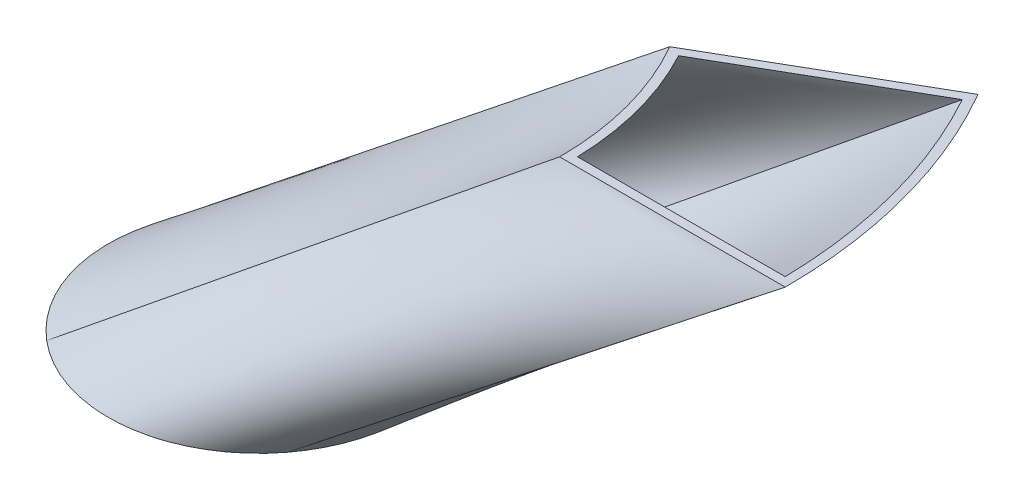
ISO-10303-21;
HEADER;
FILE_DESCRIPTION(('STEP AP214'),'2;1');
FILE_NAME('part.step','',(''),(''),'','','');
FILE_SCHEMA(('AUTOMOTIVE_DESIGN { 1 0 10303 214 1 1 1 1 }'));
ENDSEC;
DATA;
#1=APPLICATION_CONTEXT('core data for automotive mechanical design processes');
#2=APPLICATION_PROTOCOL_DEFINITION('international standard','automotive_design',2000,#1);
#3=PRODUCT_CONTEXT('',#1,'mechanical');
#4=PRODUCT('Part','Part','',(#3));
#5=PRODUCT_RELATED_PRODUCT_CATEGORY('part','',(#4));
#6=PRODUCT_DEFINITION_FORMATION('','',#4);
#7=PRODUCT_DEFINITION_CONTEXT('part definition',#1,'design');
#8=PRODUCT_DEFINITION('design','',#6,#7);
#9=PRODUCT_DEFINITION_SHAPE('','',#8);
#10=(LENGTH_UNIT() NAMED_UNIT(*) SI_UNIT(.MILLI.,.METRE.));
#11=(NAMED_UNIT(*) PLANE_ANGLE_UNIT() SI_UNIT($,.RADIAN.));
#12=(NAMED_UNIT(*) SI_UNIT($,.STERADIAN.) SOLID_ANGLE_UNIT());
#13=UNCERTAINTY_MEASURE_WITH_UNIT(LENGTH_MEASURE(1.E-05),#10,'distance_accuracy_value','');
#14=(GEOMETRIC_REPRESENTATION_CONTEXT(3) GLOBAL_UNCERTAINTY_ASSIGNED_CONTEXT((#13)) GLOBAL_UNIT_ASSIGNED_CONTEXT((#10,
#11,#12)) REPRESENTATION_CONTEXT('',''));
#15=CARTESIAN_POINT('',(0.,0.,0.));
#16=DIRECTION('',(0.,0.,1.));
#17=DIRECTION('',(1.,0.,0.));
#18=AXIS2_PLACEMENT_3D('',#15,#16,#17);
#19=CARTESIAN_POINT('',(-9.47385091124638E-13,-100.,0.));
#20=DIRECTION('',(0.,-1.,0.));
#21=DIRECTION('',(1.,0.,0.));
#22=AXIS2_PLACEMENT_3D('',#19,#20,#21);
#23=PLANE('',#22);
#24=CARTESIAN_POINT('',(-9.47385091124638E-13,-100.,0.));
#25=DIRECTION('',(0.,-1.,0.));
#26=DIRECTION('',(1.,0.,0.));
#27=AXIS2_PLACEMENT_3D('',#24,#25,#26);
#28=CIRCLE('',#27,47.);
#29=CARTESIAN_POINT('',(-44.2521494595978,-99.9999999999997,-15.8350013642407));
#30=VERTEX_POINT('',#29);
#31=CARTESIAN_POINT('',(18.164088977322,-100.,-43.3481934066911));
#32=VERTEX_POINT('',#31);
#33=EDGE_CURVE('E74',#30,#32,#28,.T.);
#34=ORIENTED_EDGE('',*,*,#33,.F.);
#35=CARTESIAN_POINT('',(-9.47385091124638E-13,-100.,0.));
#36=DIRECTION('',(0.,-1.,0.));
#37=DIRECTION('',(1.,0.,0.));
#38=AXIS2_PLACEMENT_3D('',#35,#36,#37);
#39=CIRCLE('',#38,47.);
#40=CARTESIAN_POINT('',(-30.4059849219572,-99.9999999999998,35.8395881801922));
#41=VERTEX_POINT('',#40);
#42=EDGE_CURVE('E143',#41,#30,#39,.T.);
#43=ORIENTED_EDGE('',*,*,#42,.F.);
#44=CARTESIAN_POINT('',(-9.47385091124638E-13,-100.,0.));
#45=DIRECTION('',(0.,-1.,0.));
#46=DIRECTION('',(1.,0.,0.));
#47=AXIS2_PLACEMENT_3D('',#44,#45,#46);
#48=CIRCLE('',#47,47.);
#49=CARTESIAN_POINT('',(37.4046591943072,-100.,28.4585922096941));
#50=VERTEX_POINT('',#49);
#51=EDGE_CURVE('E243',#50,#41,#48,.T.);
#52=ORIENTED_EDGE('',*,*,#51,.F.);
#53=CARTESIAN_POINT('',(-9.47385091124638E-13,-100.,0.));
#54=DIRECTION('',(0.,-1.,0.));
#55=DIRECTION('',(1.,0.,0.));
#56=AXIS2_PLACEMENT_3D('',#53,#54,#55);
#57=CIRCLE('',#56,47.);
#58=EDGE_CURVE('E262',#32,#50,#57,.T.);
#59=ORIENTED_EDGE('',*,*,#58,.F.);
#60=EDGE_LOOP('',(#34,#43,#52,#59));
#61=FACE_BOUND('',#60,.T.);
#62=CARTESIAN_POINT('',(-9.47385091124638E-13,-100.,0.));
#63=DIRECTION('',(0.,-1.,0.));
#64=DIRECTION('',(1.,0.,0.));
#65=AXIS2_PLACEMENT_3D('',#62,#63,#64);
#66=CIRCLE('',#65,50.);
#67=CARTESIAN_POINT('',(39.7921906322417,-100.,30.2750980954192));
#68=VERTEX_POINT('',#67);
#69=CARTESIAN_POINT('',(-32.3467924701671,-99.9999999999998,38.1272214682895));
#70=VERTEX_POINT('',#69);
#71=EDGE_CURVE('E12',#68,#70,#66,.T.);
#72=ORIENTED_EDGE('',*,*,#71,.T.);
#73=CARTESIAN_POINT('',(-47.0767547442529,-99.9999999999997,-16.845746132171));
#74=VERTEX_POINT('',#73);
#75=EDGE_CURVE('E80',#70,#74,#66,.T.);
#76=ORIENTED_EDGE('',*,*,#75,.T.);
#77=CARTESIAN_POINT('',(19.3234989120447,-100.,-46.1150993688203));
#78=VERTEX_POINT('',#77);
#79=EDGE_CURVE('E380',#74,#78,#66,.T.);
#80=ORIENTED_EDGE('',*,*,#79,.T.);
#81=EDGE_CURVE('E371',#78,#68,#66,.T.);
#82=ORIENTED_EDGE('',*,*,#81,.T.);
#83=EDGE_LOOP('',(#72,#76,#80,#82));
#84=FACE_BOUND('',#83,.T.);
#85=ADVANCED_FACE('F70',(#61,#84),#23,.T.);
#86=CARTESIAN_POINT('',(0.,0.,0.));
#87=DIRECTION('',(0.,1.,0.));
#88=DIRECTION('',(0.,0.,1.));
#89=AXIS2_PLACEMENT_3D('',#86,#87,#88);
#90=PLANE('',#89);
#91=DIRECTION('',(-0.866025403784439,0.,0.5));
#92=VECTOR('',#91,1.);
#93=CARTESIAN_POINT('',(150.433710086065,0.,-83.3888413982461));
#94=LINE('',#93,#92);
#95=CARTESIAN_POINT('',(150.433710086065,0.,-83.3888413982461));
#96=VERTEX_POINT('',#95);
#97=CARTESIAN_POINT('',(90.6627725006349,0.,-48.8800744935819));
#98=VERTEX_POINT('',#97);
#99=EDGE_CURVE('E151',#96,#98,#94,.T.);
#100=ORIENTED_EDGE('',*,*,#99,.F.);
#101=CARTESIAN_POINT('',(0.,0.,0.));
#102=DIRECTION('',(0.,1.,0.));
#103=DIRECTION('',(0.,0.,1.));
#104=AXIS2_PLACEMENT_3D('',#101,#102,#103);
#105=CIRCLE('',#104,172.);
#106=CARTESIAN_POINT('',(171.973835219198,0.,-3.));
#107=VERTEX_POINT('',#106);
#108=EDGE_CURVE('E158',#107,#96,#105,.T.);
#109=ORIENTED_EDGE('',*,*,#108,.F.);
#110=DIRECTION('',(1.,0.,0.));
#111=VECTOR('',#110,1.);
#112=CARTESIAN_POINT('',(102.95630140987,0.,-3.));
#113=LINE('',#112,#111);
#114=CARTESIAN_POINT('',(102.95630140987,0.,-3.));
#115=VERTEX_POINT('',#114);
#116=EDGE_CURVE('E165',#115,#107,#113,.T.);
#117=ORIENTED_EDGE('',*,*,#116,.F.);
#118=CARTESIAN_POINT('',(0.,0.,0.));
#119=DIRECTION('',(0.,1.,0.));
#120=DIRECTION('',(0.,0.,1.));
#121=AXIS2_PLACEMENT_3D('',#118,#119,#120);
#122=CIRCLE('',#121,103.);
#123=EDGE_CURVE('E139',#115,#98,#122,.T.);
#124=ORIENTED_EDGE('',*,*,#123,.T.);
#125=EDGE_LOOP('',(#100,#109,#117,#124));
#126=FACE_BOUND('',#125,.T.);
#127=DIRECTION('',(0.866025403784438,0.,-0.500000000000001));
#128=VECTOR('',#127,1.);
#129=CARTESIAN_POINT('',(86.6025403784438,0.,-50.0000000000001));
#130=LINE('',#129,#128);
#131=CARTESIAN_POINT('',(86.6025403784438,0.,-50.0000000000001));
#132=VERTEX_POINT('',#131);
#133=CARTESIAN_POINT('',(151.554445662277,0.,-87.5000000000002));
#134=VERTEX_POINT('',#133);
#135=EDGE_CURVE('E293',#132,#134,#130,.T.);
#136=ORIENTED_EDGE('',*,*,#135,.F.);
#137=CARTESIAN_POINT('',(0.,0.,0.));
#138=DIRECTION('',(0.,1.,0.));
#139=DIRECTION('',(0.,0.,1.));
#140=AXIS2_PLACEMENT_3D('',#137,#138,#139);
#141=CIRCLE('',#140,100.);
#142=CARTESIAN_POINT('',(100.,0.,0.));
#143=VERTEX_POINT('',#142);
#144=EDGE_CURVE('E304',#143,#132,#141,.T.);
#145=ORIENTED_EDGE('',*,*,#144,.F.);
#146=DIRECTION('',(1.,0.,0.));
#147=VECTOR('',#146,1.);
#148=CARTESIAN_POINT('',(100.,0.,0.));
#149=LINE('',#148,#147);
#150=CARTESIAN_POINT('',(175.,0.,0.));
#151=VERTEX_POINT('',#150);
#152=EDGE_CURVE('E422',#143,#151,#149,.T.);
#153=ORIENTED_EDGE('',*,*,#152,.T.);
#154=CARTESIAN_POINT('',(0.,0.,0.));
#155=DIRECTION('',(0.,1.,0.));
#156=DIRECTION('',(0.,0.,1.));
#157=AXIS2_PLACEMENT_3D('',#154,#155,#156);
#158=CIRCLE('',#157,175.);
#159=EDGE_CURVE('E628',#151,#134,#158,.T.);
#160=ORIENTED_EDGE('',*,*,#159,.T.);
#161=EDGE_LOOP('',(#136,#145,#153,#160));
#162=FACE_BOUND('',#161,.T.);
#163=ADVANCED_FACE('F163',(#126,#162),#90,.T.);
#164=CARTESIAN_POINT('',(100.,0.,0.));
#165=CARTESIAN_POINT('',(-32.3467924701671,-99.9999999999998,38.1272214682895));
#166=CARTESIAN_POINT('',(100.,0.,-17.6556712802933));
#167=CARTESIAN_POINT('',(-48.7574498481755,-99.9999999999997,24.2045670480892));
#168=CARTESIAN_POINT('',(95.4303760185905,0.,-34.7097401503988));
#169=CARTESIAN_POINT('',(-54.3274737163105,-99.9999999999996,3.41695497283838));
#170=CARTESIAN_POINT('',(86.6025403784438,0.,-50.0000000000001));
#171=CARTESIAN_POINT('',(-47.0767547442529,-99.9999999999997,-16.845746132171));
#172=(BOUNDED_SURFACE() B_SPLINE_SURFACE(3,1,((#164,#165),(#166,#167),(#168,#169),(#170,#171)),
.UNSPECIFIED.,.F.,.F.,.F.) B_SPLINE_SURFACE_WITH_KNOTS((4,4),(2,2),(0.,1.),(0.,1.),
.UNSPECIFIED.) GEOMETRIC_REPRESENTATION_ITEM() RATIONAL_B_SPLINE_SURFACE(((1.,1.),
(0.977283884192712,0.881502043965084),(0.977283884192712,0.881502043965084),(1.,1.))) REPRESENTATION_ITEM('') SURFACE());
#173=DIRECTION('',(-0.785406891823686,-0.587530695088423,0.194791418201037));
#174=VECTOR('',#173,1.);
#175=CARTESIAN_POINT('',(19.7628928170955,-49.9999999999998,-33.4228730660856));
#176=LINE('',#175,#174);
#177=EDGE_CURVE('E316',#132,#74,#176,.T.);
#178=DIRECTION('',(0.777578029727208,0.587530695088423,-0.224009129310545));
#179=VECTOR('',#178,1.);
#180=CARTESIAN_POINT('',(33.8266037649164,-49.9999999999999,19.0636107341448));
#181=LINE('',#180,#179);
#182=EDGE_CURVE('E309',#70,#143,#181,.T.);
#183=ORIENTED_EDGE('',*,*,#144,.T.);
#184=ORIENTED_EDGE('',*,*,#177,.T.);
#185=ORIENTED_EDGE('',*,*,#75,.F.);
#186=ORIENTED_EDGE('',*,*,#182,.T.);
#187=EDGE_LOOP('',(#183,#184,#185,#186));
#188=FACE_BOUND('',#187,.T.);
#189=ADVANCED_FACE('F186',(#188),#172,.T.);
#190=CARTESIAN_POINT('',(86.6025403784438,0.,-50.0000000000001));
#191=CARTESIAN_POINT('',(-47.0767547442529,-99.9999999999997,-16.845746132171));
#192=CARTESIAN_POINT('',(89.3088697652702,0.,-51.5625000000001));
#193=CARTESIAN_POINT('',(-46.0580775186511,-99.9999999999997,-19.6925192900322));
#194=CARTESIAN_POINT('',(92.0151991520965,0.,-53.1250000000001));
#195=CARTESIAN_POINT('',(-44.7390432138817,-99.9999999999997,-22.5598721897661));
#196=CARTESIAN_POINT('',(97.4278579257493,0.,-56.2500000000001));
#197=CARTESIAN_POINT('',(-41.4477874243292,-99.9999999999997,-28.1533432924007));
#198=CARTESIAN_POINT('',(100.134187312576,0.,-57.8125000000001));
#199=CARTESIAN_POINT('',(-39.4746623104586,-99.9999999999998,-30.8783963774015));
#200=CARTESIAN_POINT('',(105.546846086228,0.,-60.9375000000001));
#201=CARTESIAN_POINT('',(-34.8966761298336,-99.9999999999998,-35.9714653920876));
#202=CARTESIAN_POINT('',(108.253175473055,0.,-62.5000000000001));
#203=CARTESIAN_POINT('',(-32.2916424756433,-99.9999999999998,-38.3378544433503));
#204=CARTESIAN_POINT('',(113.665834246707,0.,-65.6250000000001));
#205=CARTESIAN_POINT('',(-26.5656531908016,-99.9999999999998,-42.5065562900635));
#206=CARTESIAN_POINT('',(116.372163633534,0.,-67.1875000000002));
#207=CARTESIAN_POINT('',(-23.4455919356764,-99.9999999999999,-44.3073000259783));
#208=CARTESIAN_POINT('',(121.784822407187,0.,-70.3125000000002));
#209=CARTESIAN_POINT('',(-16.889730651106,-99.9999999999999,-47.1971356688029));
#210=CARTESIAN_POINT('',(124.491151794013,0.,-71.8750000000001));
#211=CARTESIAN_POINT('',(-13.4556398538664,-99.9999999999999,-48.2854741430308));
#212=CARTESIAN_POINT('',(129.903810567666,0.,-75.0000000000002));
#213=CARTESIAN_POINT('',(-6.51559700773002,-100.,-49.6999824217987));
#214=CARTESIAN_POINT('',(132.610139954492,0.,-76.5625000000002));
#215=CARTESIAN_POINT('',(-3.01140655171694,-100.,-50.0265505301422));
#216=CARTESIAN_POINT('',(138.022798728145,0.,-79.6875000000002));
#217=CARTESIAN_POINT('',(3.83652135545357,-100.,-49.9700453397206));
#218=CARTESIAN_POINT('',(140.729128114971,0.,-81.2500000000002));
#219=CARTESIAN_POINT('',(7.17917431982463,-100.,-49.5881969524767));
#220=CARTESIAN_POINT('',(146.141786888624,0.,-84.3750000000002));
#221=CARTESIAN_POINT('',(13.5284409169159,-100.,-48.2442857473251));
#222=CARTESIAN_POINT('',(148.84811627545,0.,-85.9375000000002));
#223=CARTESIAN_POINT('',(16.5348779085698,-100.,-47.2836085049665));
#224=CARTESIAN_POINT('',(151.554445662277,0.,-87.5000000000002));
#225=CARTESIAN_POINT('',(19.3234989120447,-100.,-46.1150993688203));
#226=B_SPLINE_SURFACE_WITH_KNOTS('',3,1,((#190,#191),(#192,#193),(#194,#195),(#196,#197),(#198,
#199),(#200,#201),(#202,#203),(#204,#205),(#206,#207),(#208,#209),(#210,#211),(#212,#213),(#214,
#215),(#216,#217),(#218,#219),(#220,#221),(#222,#223),(#224,#225)),.UNSPECIFIED.,.F.,.F.,.F.,(4,
2,2,2,2,2,2,2,4),(2,2),(0.,0.125,0.25,0.375,0.5,0.625,0.75,0.875,1.),(0.,1.),.UNSPECIFIED.);
#227=DIRECTION('',(-0.773853121825687,-0.585228451315108,0.24219621304215));
#228=VECTOR('',#227,1.);
#229=CARTESIAN_POINT('',(85.4389722871607,-50.0000000000001,-66.8075496844102));
#230=LINE('',#229,#228);
#231=EDGE_CURVE('E320',#134,#78,#230,.T.);
#232=ORIENTED_EDGE('',*,*,#135,.T.);
#233=ORIENTED_EDGE('',*,*,#231,.T.);
#234=ORIENTED_EDGE('',*,*,#79,.F.);
#235=ORIENTED_EDGE('',*,*,#177,.F.);
#236=EDGE_LOOP('',(#232,#233,#234,#235));
#237=FACE_BOUND('',#236,.T.);
#238=ADVANCED_FACE('F332',(#237),#226,.T.);
#239=CARTESIAN_POINT('',(175.,0.,0.));
#240=CARTESIAN_POINT('',(39.7921906322417,-100.,30.2750980954192));
#241=CARTESIAN_POINT('',(171.875,0.,0.));
#242=CARTESIAN_POINT('',(37.9614285697787,-100.,32.6813671936135));
#243=CARTESIAN_POINT('',(168.75,0.,0.));
#244=CARTESIAN_POINT('',(35.8381163813085,-100.,35.0165565861606));
#245=CARTESIAN_POINT('',(162.5,0.,0.));
#246=CARTESIAN_POINT('',(31.0114458154033,-100.,39.3550511287981));
#247=CARTESIAN_POINT('',(159.375,0.,0.));
#248=CARTESIAN_POINT('',(28.3075476258445,-100.,41.3570680147309));
#249=CARTESIAN_POINT('',(153.125,0.,0.));
#250=CARTESIAN_POINT('',(22.4053206901613,-100.,44.829966898667));
#251=CARTESIAN_POINT('',(150.,0.,0.));
#252=CARTESIAN_POINT('',(19.2073186813832,-100.,46.2992458487822));
#253=CARTESIAN_POINT('',(143.75,0.,0.));
#254=CARTESIAN_POINT('',(12.4898111338927,-100.,48.544267168574));
#255=CARTESIAN_POINT('',(140.625,0.,0.));
#256=CARTESIAN_POINT('',(8.97163202746692,-100.,49.3187838005965));
#257=CARTESIAN_POINT('',(134.375,0.,0.));
#258=CARTESIAN_POINT('',(1.8491717899298,-100.,50.0940433634338));
#259=CARTESIAN_POINT('',(131.25,0.,0.));
#260=CARTESIAN_POINT('',(-1.75325238632964,-100.,50.0945841699885));
#261=CARTESIAN_POINT('',(125.,0.,0.));
#262=CARTESIAN_POINT('',(-8.79645549215665,-99.9999999999999,49.3473771123527));
#263=CARTESIAN_POINT('',(121.875,0.,0.));
#264=CARTESIAN_POINT('',(-12.2356753400302,-100.,48.600540905817));
#265=CARTESIAN_POINT('',(115.625,0.,0.));
#266=CARTESIAN_POINT('',(-18.7468621779686,-99.9999999999998,46.4788068461839));
#267=CARTESIAN_POINT('',(112.5,0.,0.));
#268=CARTESIAN_POINT('',(-21.818165193926,-99.9999999999999,45.1054042048474));
#269=CARTESIAN_POINT('',(106.25,0.,0.));
#270=CARTESIAN_POINT('',(-27.4652118693484,-99.9999999999998,41.9069440294079));
#271=CARTESIAN_POINT('',(103.125,0.,0.));
#272=CARTESIAN_POINT('',(-30.0412055356088,-99.9999999999998,40.0832607290081));
#273=CARTESIAN_POINT('',(100.,0.,0.));
#274=CARTESIAN_POINT('',(-32.3467924701672,-99.9999999999998,38.1272214682895));
#275=B_SPLINE_SURFACE_WITH_KNOTS('',3,1,((#239,#240),(#241,#242),(#243,#244),(#245,#246),(#247,
#248),(#249,#250),(#251,#252),(#253,#254),(#255,#256),(#257,#258),(#259,#260),(#261,#262),(#263,
#264),(#265,#266),(#267,#268),(#269,#270),(#271,#272),(#273,#274)),.UNSPECIFIED.,.F.,.F.,.F.,(4,
2,2,2,2,2,2,2,4),(2,2),(0.,0.125,0.25,0.375,0.5,0.625,0.75,0.875,1.),(0.,1.),.UNSPECIFIED.);
#276=DIRECTION('',(-0.791274568820014,-0.585228451315109,0.177178487717951));
#277=VECTOR('',#276,1.);
#278=CARTESIAN_POINT('',(107.396095316121,-50.0000000000001,15.1375490477096));
#279=LINE('',#278,#277);
#280=EDGE_CURVE('E407',#151,#68,#279,.T.);
#281=ORIENTED_EDGE('',*,*,#152,.F.);
#282=ORIENTED_EDGE('',*,*,#182,.F.);
#283=ORIENTED_EDGE('',*,*,#71,.F.);
#284=ORIENTED_EDGE('',*,*,#280,.F.);
#285=EDGE_LOOP('',(#281,#282,#283,#284));
#286=FACE_BOUND('',#285,.T.);
#287=ADVANCED_FACE('F343',(#286),#275,.T.);
#288=CARTESIAN_POINT('',(151.554445662277,0.,-87.5000000000002));
#289=CARTESIAN_POINT('',(19.3234989120447,-100.,-46.1150993688203));
#290=CARTESIAN_POINT('',(167.003158032533,0.,-60.7420452631979));
#291=CARTESIAN_POINT('',(52.1200409616694,-100.,-32.3724434212268));
#292=CARTESIAN_POINT('',(175.,0.,-30.8974247405133));
#293=CARTESIAN_POINT('',(61.3235012297045,-100.,1.97533790452157));
#294=CARTESIAN_POINT('',(175.,0.,0.));
#295=CARTESIAN_POINT('',(39.7921906322417,-100.,30.2750980954192));
#296=(BOUNDED_SURFACE() B_SPLINE_SURFACE(3,1,((#288,#289),(#290,#291),(#292,#293),(#294,#295)),
.UNSPECIFIED.,.F.,.F.,.F.) B_SPLINE_SURFACE_WITH_KNOTS((4,4),(2,2),(0.,1.),(0.,1.),
.UNSPECIFIED.) GEOMETRIC_REPRESENTATION_ITEM() RATIONAL_B_SPLINE_SURFACE(((1.,1.),
(0.977283884192712,0.741340435158128),(0.977283884192712,0.741340435158128),(1.,1.))) REPRESENTATION_ITEM('') SURFACE());
#297=ORIENTED_EDGE('',*,*,#159,.F.);
#298=ORIENTED_EDGE('',*,*,#280,.T.);
#299=ORIENTED_EDGE('',*,*,#81,.F.);
#300=ORIENTED_EDGE('',*,*,#231,.F.);
#301=EDGE_LOOP('',(#297,#298,#299,#300));
#302=FACE_BOUND('',#301,.T.);
#303=ADVANCED_FACE('F435',(#302),#296,.T.);
#304=CARTESIAN_POINT('',(90.662772500635,0.,-48.8800744935819));
#305=CARTESIAN_POINT('',(-44.2521494595978,-99.9999999999997,-15.8350013642407));
#306=CARTESIAN_POINT('',(93.1532282333612,0.,-50.3179397812762));
#307=CARTESIAN_POINT('',(-43.2945928675321,-99.9999999999997,-18.5109681326302));
#308=CARTESIAN_POINT('',(95.6436839660874,0.,-51.7558050689706));
#309=CARTESIAN_POINT('',(-42.0547006210488,-99.9999999999997,-21.2062798583801));
#310=CARTESIAN_POINT('',(100.62459543154,0.,-54.6315356443592));
#311=CARTESIAN_POINT('',(-38.9609201788695,-99.9999999999998,-26.4641426948566));
#312=CARTESIAN_POINT('',(103.115051164266,0.,-56.0694009320536));
#313=CARTESIAN_POINT('',(-37.1061825718312,-99.9999999999998,-29.0256925947574));
#314=CARTESIAN_POINT('',(108.095962629719,0.,-58.9451315074423));
#315=CARTESIAN_POINT('',(-32.8028755620437,-99.9999999999998,-33.8131774685623));
#316=CARTESIAN_POINT('',(110.586418362445,0.,-60.3829967951366));
#317=CARTESIAN_POINT('',(-30.3541439271048,-99.9999999999998,-36.0375831767493));
#318=CARTESIAN_POINT('',(115.567329827897,0.,-63.2587273705253));
#319=CARTESIAN_POINT('',(-24.9717139993536,-99.9999999999999,-39.9561629126596));
#320=CARTESIAN_POINT('',(118.057785560624,0.,-64.6965926582196));
#321=CARTESIAN_POINT('',(-22.0388564195359,-99.9999999999998,-41.6488620244196));
#322=CARTESIAN_POINT('',(123.038697026076,0.,-67.5723232336083));
#323=CARTESIAN_POINT('',(-15.8763468120397,-99.9999999999999,-44.3653075286748));
#324=CARTESIAN_POINT('',(125.529152758802,0.,-69.0101885213026));
#325=CARTESIAN_POINT('',(-12.6483014626345,-99.9999999999999,-45.3883456944489));
#326=CARTESIAN_POINT('',(130.510064224255,0.,-71.8859190966913));
#327=CARTESIAN_POINT('',(-6.12466118726628,-100.,-46.7179834764908));
#328=CARTESIAN_POINT('',(133.000519956981,0.,-73.3237843843857));
#329=CARTESIAN_POINT('',(-2.83072215861399,-100.,-47.0249574983337));
#330=CARTESIAN_POINT('',(137.981431422434,0.,-76.1995149597743));
#331=CARTESIAN_POINT('',(3.60633007412629,-100.,-46.9718426193373));
#332=CARTESIAN_POINT('',(140.47188715516,0.,-77.6373802474687));
#333=CARTESIAN_POINT('',(6.7484238606351,-100.,-46.6129051353281));
#334=CARTESIAN_POINT('',(145.452798620612,0.,-80.5131108228574));
#335=CARTESIAN_POINT('',(12.7167344619009,-100.,-45.3496286024856));
#336=CARTESIAN_POINT('',(147.943254353338,0.,-81.9509761105517));
#337=CARTESIAN_POINT('',(15.5427852340556,-100.,-44.4465919946685));
#338=CARTESIAN_POINT('',(150.433710086065,0.,-83.3888413982461));
#339=CARTESIAN_POINT('',(18.164088977322,-100.,-43.3481934066911));
#340=B_SPLINE_SURFACE_WITH_KNOTS('',3,1,((#304,#305),(#306,#307),(#308,#309),(#310,#311),(#312,
#313),(#314,#315),(#316,#317),(#318,#319),(#320,#321),(#322,#323),(#324,#325),(#326,#327),(#328,
#329),(#330,#331),(#332,#333),(#334,#335),(#336,#337),(#338,#339)),.UNSPECIFIED.,.F.,.F.,.F.,(4,
2,2,2,2,2,2,2,4),(2,2),(0.,0.125,0.25,0.375,0.5,0.625,0.75,0.875,1.),(0.,1.),.UNSPECIFIED.);
#341=DIRECTION('',(0.788261928175854,0.58426593346598,-0.193071104983661));
#342=VECTOR('',#341,1.);
#343=CARTESIAN_POINT('',(23.2053115205186,-49.9999999999999,-32.3575379289113));
#344=LINE('',#343,#342);
#345=EDGE_CURVE('E135',#30,#98,#344,.T.);
#346=DIRECTION('',(-0.775398153531292,-0.58622542881091,0.23472846038716));
#347=VECTOR('',#346,1.);
#348=CARTESIAN_POINT('',(84.2988995316933,-50.0000000000001,-63.3685174024686));
#349=LINE('',#348,#347);
#350=EDGE_CURVE('E148',#96,#32,#349,.T.);
#351=ORIENTED_EDGE('',*,*,#99,.T.);
#352=ORIENTED_EDGE('',*,*,#345,.F.);
#353=ORIENTED_EDGE('',*,*,#33,.T.);
#354=ORIENTED_EDGE('',*,*,#350,.F.);
#355=EDGE_LOOP('',(#351,#352,#353,#354));
#356=FACE_BOUND('',#355,.T.);
#357=ADVANCED_FACE('F153',(#356),#340,.F.);
#358=CARTESIAN_POINT('',(150.433710086065,0.,-83.3888413982461));
#359=CARTESIAN_POINT('',(18.164088977322,-100.,-43.3481934066911));
#360=CARTESIAN_POINT('',(164.155082364148,0.,-58.6354462838307));
#361=CARTESIAN_POINT('',(48.9928385039692,-100.,-30.4300968159532));
#362=CARTESIAN_POINT('',(171.480194629594,0.,-31.2977551380388));
#363=CARTESIAN_POINT('',(57.6440911559222,-100.,1.85681763025028));
#364=CARTESIAN_POINT('',(171.973835219198,0.,-3.));
#365=CARTESIAN_POINT('',(37.4046591943072,-100.,28.4585922096941));
#366=(BOUNDED_SURFACE() B_SPLINE_SURFACE(3,1,((#358,#359),(#360,#361),(#362,#363),(#364,#365)),
.UNSPECIFIED.,.F.,.F.,.F.) B_SPLINE_SURFACE_WITH_KNOTS((4,4),(2,2),(0.,1.),(0.,1.),
.UNSPECIFIED.) GEOMETRIC_REPRESENTATION_ITEM() RATIONAL_B_SPLINE_SURFACE(((1.,1.),
(0.98019544968803,0.741340435158128),(0.98019544968803,0.741340435158128),(1.,1.))) REPRESENTATION_ITEM('') SURFACE());
#367=DIRECTION('',(-0.788878729199226,-0.586225428810911,0.184418267079154));
#368=VECTOR('',#367,1.);
#369=CARTESIAN_POINT('',(104.689247206753,-50.0000000000001,12.729296104847));
#370=LINE('',#369,#368);
#371=EDGE_CURVE('E88',#107,#50,#370,.T.);
#372=ORIENTED_EDGE('',*,*,#108,.T.);
#373=ORIENTED_EDGE('',*,*,#350,.T.);
#374=ORIENTED_EDGE('',*,*,#58,.T.);
#375=ORIENTED_EDGE('',*,*,#371,.F.);
#376=EDGE_LOOP('',(#372,#373,#374,#375));
#377=FACE_BOUND('',#376,.T.);
#378=ADVANCED_FACE('F455',(#377),#366,.F.);
#379=CARTESIAN_POINT('',(102.95630140987,0.,-3.));
#380=CARTESIAN_POINT('',(-30.4059849219572,-99.9999999999998,35.8395881801922));
#381=CARTESIAN_POINT('',(102.486714943158,0.,-19.1156286016162));
#382=CARTESIAN_POINT('',(-45.8320028572851,-99.9999999999997,22.7522930252039));
#383=CARTESIAN_POINT('',(98.3139129919967,0.,-34.688737493271));
#384=CARTESIAN_POINT('',(-51.0678252933319,-99.9999999999996,3.2119376744681));
#385=CARTESIAN_POINT('',(90.6627725006349,0.,-48.8800744935819));
#386=CARTESIAN_POINT('',(-44.2521494595978,-99.9999999999997,-15.8350013642407));
#387=(BOUNDED_SURFACE() B_SPLINE_SURFACE(3,1,((#379,#380),(#381,#382),(#383,#384),(#385,#386)),
.UNSPECIFIED.,.F.,.F.,.F.) B_SPLINE_SURFACE_WITH_KNOTS((4,4),(2,2),(0.,1.),(0.,1.),
.UNSPECIFIED.) GEOMETRIC_REPRESENTATION_ITEM() RATIONAL_B_SPLINE_SURFACE(((1.,1.),
(0.982036295445324,0.881502043965084),(0.982036295445324,0.881502043965084),(1.,1.))) REPRESENTATION_ITEM('') SURFACE());
#388=DIRECTION('',(-0.779190407128225,-0.58426593346598,0.226926482435343));
#389=VECTOR('',#388,1.);
#390=CARTESIAN_POINT('',(36.2751582439564,-49.9999999999999,16.4197940900961));
#391=LINE('',#390,#389);
#392=EDGE_CURVE('E93',#115,#41,#391,.T.);
#393=ORIENTED_EDGE('',*,*,#123,.F.);
#394=ORIENTED_EDGE('',*,*,#392,.T.);
#395=ORIENTED_EDGE('',*,*,#42,.T.);
#396=ORIENTED_EDGE('',*,*,#345,.T.);
#397=EDGE_LOOP('',(#393,#394,#395,#396));
#398=FACE_BOUND('',#397,.T.);
#399=ADVANCED_FACE('F137',(#398),#387,.F.);
#400=CARTESIAN_POINT('',(171.973835219198,0.,-3.));
#401=CARTESIAN_POINT('',(37.4046591943072,-100.,28.4585922096941));
#402=CARTESIAN_POINT('',(169.09810464381,0.,-3.));
#403=CARTESIAN_POINT('',(35.6837428555919,-100.,30.7204851619967));
#404=CARTESIAN_POINT('',(166.222374068421,0.,-3.));
#405=CARTESIAN_POINT('',(33.6878293984299,-100.,32.915563190991));
#406=CARTESIAN_POINT('',(160.470912917644,0.,-3.));
#407=CARTESIAN_POINT('',(29.150759066479,-100.,36.9937480610702));
#408=CARTESIAN_POINT('',(157.595182342255,0.,-3.));
#409=CARTESIAN_POINT('',(26.6090947682938,-100.,38.8756439338471));
#410=CARTESIAN_POINT('',(151.843721191478,0.,-3.));
#411=CARTESIAN_POINT('',(21.0610014487515,-100.,42.140168884747));
#412=CARTESIAN_POINT('',(148.967990616089,0.,-3.));
#413=CARTESIAN_POINT('',(18.0548795605002,-100.,43.5212910978553));
#414=CARTESIAN_POINT('',(143.216529465312,0.,-3.));
#415=CARTESIAN_POINT('',(11.7404224658591,-100.,45.6316111384596));
#416=CARTESIAN_POINT('',(140.340798889923,0.,-3.));
#417=CARTESIAN_POINT('',(8.43333410581886,-100.,46.3596567725607));
#418=CARTESIAN_POINT('',(134.589337739145,0.,-3.));
#419=CARTESIAN_POINT('',(1.73822148253396,-100.,47.0884007616278));
#420=CARTESIAN_POINT('',(131.713607163757,0.,-3.));
#421=CARTESIAN_POINT('',(-1.64805724314991,-100.,47.0889091197892));
#422=CARTESIAN_POINT('',(125.962146012979,0.,-3.));
#423=CARTESIAN_POINT('',(-8.26866816262729,-99.9999999999999,46.3865344856115));
#424=CARTESIAN_POINT('',(123.086415437591,0.,-3.));
#425=CARTESIAN_POINT('',(-11.5015348196284,-99.9999999999999,45.6845084514679));
#426=CARTESIAN_POINT('',(117.334954286813,0.,-3.));
#427=CARTESIAN_POINT('',(-17.6220504472905,-99.9999999999999,43.6900784354129));
#428=CARTESIAN_POINT('',(114.459223711425,0.,-3.));
#429=CARTESIAN_POINT('',(-20.5090752822905,-99.9999999999999,42.3990799525565));
#430=CARTESIAN_POINT('',(108.707762560647,0.,-3.));
#431=CARTESIAN_POINT('',(-25.8172991571875,-99.9999999999998,39.3925273876434));
#432=CARTESIAN_POINT('',(105.832031985259,0.,-3.));
#433=CARTESIAN_POINT('',(-28.2387332034723,-99.9999999999998,37.6782650852676));
#434=CARTESIAN_POINT('',(102.95630140987,0.,-3.));
#435=CARTESIAN_POINT('',(-30.4059849219572,-99.9999999999998,35.8395881801922));
#436=B_SPLINE_SURFACE_WITH_KNOTS('',3,1,((#400,#401),(#402,#403),(#404,#405),(#406,#407),(#408,
#409),(#410,#411),(#412,#413),(#414,#415),(#416,#417),(#418,#419),(#420,#421),(#422,#423),(#424,
#425),(#426,#427),(#428,#429),(#430,#431),(#432,#433),(#434,#435)),.UNSPECIFIED.,.F.,.F.,.F.,(4,
2,2,2,2,2,2,2,4),(2,2),(0.,0.125,0.25,0.375,0.5,0.625,0.75,0.875,1.),(0.,1.),.UNSPECIFIED.);
#437=ORIENTED_EDGE('',*,*,#116,.T.);
#438=ORIENTED_EDGE('',*,*,#371,.T.);
#439=ORIENTED_EDGE('',*,*,#51,.T.);
#440=ORIENTED_EDGE('',*,*,#392,.F.);
#441=EDGE_LOOP('',(#437,#438,#439,#440));
#442=FACE_BOUND('',#441,.T.);
#443=ADVANCED_FACE('F187',(#442),#436,.F.);
#444=CLOSED_SHELL('',(#85,#163,#189,#238,#287,#303,#357,#378,#399,#443));
#445=MANIFOLD_SOLID_BREP('B2',#444);
#446=ADVANCED_BREP_SHAPE_REPRESENTATION('',(#18,#445),#14);
#447=SHAPE_DEFINITION_REPRESENTATION(#9,#446);
ENDSEC;
END-ISO-10303-21;
